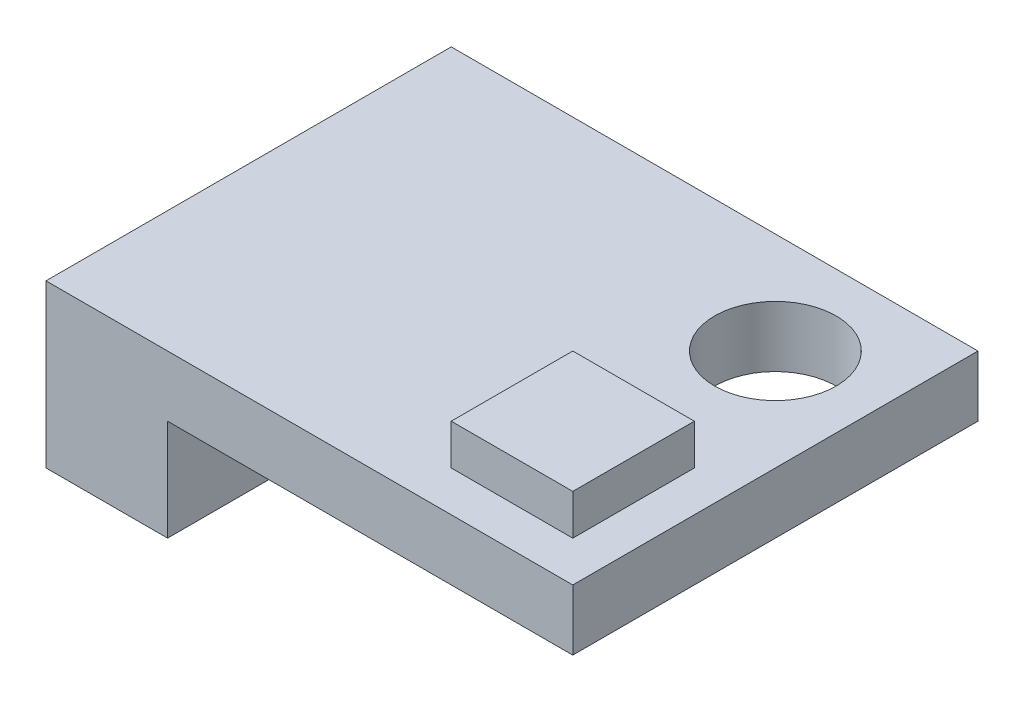
ISO-10303-21;
HEADER;
FILE_DESCRIPTION(('STEP AP214'),'2;1');
FILE_NAME('part.step','',(''),(''),'','','');
FILE_SCHEMA(('AUTOMOTIVE_DESIGN { 1 0 10303 214 1 1 1 1 }'));
ENDSEC;
DATA;
#1=APPLICATION_CONTEXT('core data for automotive mechanical design processes');
#2=APPLICATION_PROTOCOL_DEFINITION('international standard','automotive_design',2000,#1);
#3=PRODUCT_CONTEXT('',#1,'mechanical');
#4=PRODUCT('Part','Part','',(#3));
#5=PRODUCT_RELATED_PRODUCT_CATEGORY('part','',(#4));
#6=PRODUCT_DEFINITION_FORMATION('','',#4);
#7=PRODUCT_DEFINITION_CONTEXT('part definition',#1,'design');
#8=PRODUCT_DEFINITION('design','',#6,#7);
#9=PRODUCT_DEFINITION_SHAPE('','',#8);
#10=(LENGTH_UNIT() NAMED_UNIT(*) SI_UNIT(.MILLI.,.METRE.));
#11=(NAMED_UNIT(*) PLANE_ANGLE_UNIT() SI_UNIT($,.RADIAN.));
#12=(NAMED_UNIT(*) SI_UNIT($,.STERADIAN.) SOLID_ANGLE_UNIT());
#13=UNCERTAINTY_MEASURE_WITH_UNIT(LENGTH_MEASURE(1.E-05),#10,'distance_accuracy_value','');
#14=(GEOMETRIC_REPRESENTATION_CONTEXT(3) GLOBAL_UNCERTAINTY_ASSIGNED_CONTEXT((#13)) GLOBAL_UNIT_ASSIGNED_CONTEXT((#10,
#11,#12)) REPRESENTATION_CONTEXT('',''));
#15=CARTESIAN_POINT('',(0.,0.,0.));
#16=DIRECTION('',(0.,0.,1.));
#17=DIRECTION('',(1.,0.,0.));
#18=AXIS2_PLACEMENT_3D('',#15,#16,#17);
#19=CARTESIAN_POINT('',(0.,1.5,0.));
#20=DIRECTION('',(0.,1.,0.));
#21=DIRECTION('',(0.,0.,1.));
#22=AXIS2_PLACEMENT_3D('',#19,#20,#21);
#23=PLANE('',#22);
#24=DIRECTION('',(-1.,0.,0.));
#25=VECTOR('',#24,1.);
#26=CARTESIAN_POINT('',(0.,1.5,5.));
#27=LINE('',#26,#25);
#28=CARTESIAN_POINT('',(6.5,1.5,5.));
#29=VERTEX_POINT('',#28);
#30=CARTESIAN_POINT('',(-6.5,1.5,5.));
#31=VERTEX_POINT('',#30);
#32=EDGE_CURVE('E196',#29,#31,#27,.T.);
#33=ORIENTED_EDGE('',*,*,#32,.F.);
#34=DIRECTION('',(0.,0.,1.));
#35=VECTOR('',#34,1.);
#36=CARTESIAN_POINT('',(6.5,1.5,0.));
#37=LINE('',#36,#35);
#38=CARTESIAN_POINT('',(6.5,1.5,-5.));
#39=VERTEX_POINT('',#38);
#40=EDGE_CURVE('E200',#39,#29,#37,.T.);
#41=ORIENTED_EDGE('',*,*,#40,.F.);
#42=DIRECTION('',(-1.,0.,0.));
#43=VECTOR('',#42,1.);
#44=CARTESIAN_POINT('',(0.,1.5,-5.));
#45=LINE('',#44,#43);
#46=CARTESIAN_POINT('',(-6.5,1.5,-5.));
#47=VERTEX_POINT('',#46);
#48=EDGE_CURVE('E205',#39,#47,#45,.T.);
#49=ORIENTED_EDGE('',*,*,#48,.T.);
#50=DIRECTION('',(0.,0.,1.));
#51=VECTOR('',#50,1.);
#52=CARTESIAN_POINT('',(-6.5,1.5,0.));
#53=LINE('',#52,#51);
#54=EDGE_CURVE('E208',#47,#31,#53,.T.);
#55=ORIENTED_EDGE('',*,*,#54,.T.);
#56=EDGE_LOOP('',(#33,#41,#49,#55));
#57=FACE_BOUND('',#56,.T.);
#58=CARTESIAN_POINT('',(4.,1.5,-2.5));
#59=DIRECTION('',(0.,1.,0.));
#60=DIRECTION('',(0.,0.,1.));
#61=AXIS2_PLACEMENT_3D('',#58,#59,#60);
#62=CIRCLE('',#61,1.5);
#63=CARTESIAN_POINT('',(4.,1.5,-0.999999999999999));
#64=VERTEX_POINT('',#63);
#65=EDGE_CURVE('E211',#64,#64,#62,.T.);
#66=ORIENTED_EDGE('',*,*,#65,.F.);
#67=EDGE_LOOP('',(#66));
#68=FACE_BOUND('',#67,.T.);
#69=DIRECTION('',(1.,0.,0.));
#70=VECTOR('',#69,1.);
#71=CARTESIAN_POINT('',(0.,1.5,1.));
#72=LINE('',#71,#70);
#73=CARTESIAN_POINT('',(2.5,1.5,0.999999999999999));
#74=VERTEX_POINT('',#73);
#75=CARTESIAN_POINT('',(5.5,1.5,0.999999999999999));
#76=VERTEX_POINT('',#75);
#77=EDGE_CURVE('E155',#74,#76,#72,.T.);
#78=ORIENTED_EDGE('',*,*,#77,.T.);
#79=DIRECTION('',(0.,0.,-1.));
#80=VECTOR('',#79,1.);
#81=CARTESIAN_POINT('',(5.5,1.5,0.));
#82=LINE('',#81,#80);
#83=CARTESIAN_POINT('',(5.5,1.5,4.));
#84=VERTEX_POINT('',#83);
#85=EDGE_CURVE('E136',#84,#76,#82,.T.);
#86=ORIENTED_EDGE('',*,*,#85,.F.);
#87=DIRECTION('',(1.,0.,0.));
#88=VECTOR('',#87,1.);
#89=CARTESIAN_POINT('',(0.,1.5,4.));
#90=LINE('',#89,#88);
#91=CARTESIAN_POINT('',(2.5,1.5,4.));
#92=VERTEX_POINT('',#91);
#93=EDGE_CURVE('E130',#92,#84,#90,.T.);
#94=ORIENTED_EDGE('',*,*,#93,.F.);
#95=DIRECTION('',(0.,0.,-1.));
#96=VECTOR('',#95,1.);
#97=CARTESIAN_POINT('',(2.5,1.5,0.));
#98=LINE('',#97,#96);
#99=EDGE_CURVE('E55',#92,#74,#98,.T.);
#100=ORIENTED_EDGE('',*,*,#99,.T.);
#101=EDGE_LOOP('',(#78,#86,#94,#100));
#102=FACE_BOUND('',#101,.T.);
#103=ADVANCED_FACE('F39',(#57,#68,#102),#23,.T.);
#104=CARTESIAN_POINT('',(0.,0.,0.));
#105=DIRECTION('',(0.,1.,0.));
#106=DIRECTION('',(0.,0.,1.));
#107=AXIS2_PLACEMENT_3D('',#104,#105,#106);
#108=PLANE('',#107);
#109=CARTESIAN_POINT('',(4.,0.,-2.5));
#110=DIRECTION('',(0.,1.,0.));
#111=DIRECTION('',(0.,0.,1.));
#112=AXIS2_PLACEMENT_3D('',#109,#110,#111);
#113=CIRCLE('',#112,1.5);
#114=CARTESIAN_POINT('',(4.,0.,-0.999999999999999));
#115=VERTEX_POINT('',#114);
#116=EDGE_CURVE('E201',#115,#115,#113,.T.);
#117=ORIENTED_EDGE('',*,*,#116,.T.);
#118=EDGE_LOOP('',(#117));
#119=FACE_BOUND('',#118,.T.);
#120=DIRECTION('',(0.,0.,1.));
#121=VECTOR('',#120,1.);
#122=CARTESIAN_POINT('',(-3.5,0.,0.));
#123=LINE('',#122,#121);
#124=CARTESIAN_POINT('',(-3.5,0.,-5.));
#125=VERTEX_POINT('',#124);
#126=CARTESIAN_POINT('',(-3.5,0.,5.));
#127=VERTEX_POINT('',#126);
#128=EDGE_CURVE('E63',#125,#127,#123,.T.);
#129=ORIENTED_EDGE('',*,*,#128,.F.);
#130=DIRECTION('',(-1.,0.,0.));
#131=VECTOR('',#130,1.);
#132=CARTESIAN_POINT('',(0.,0.,-5.));
#133=LINE('',#132,#131);
#134=CARTESIAN_POINT('',(6.5,0.,-5.));
#135=VERTEX_POINT('',#134);
#136=EDGE_CURVE('E222',#135,#125,#133,.T.);
#137=ORIENTED_EDGE('',*,*,#136,.F.);
#138=DIRECTION('',(0.,0.,1.));
#139=VECTOR('',#138,1.);
#140=CARTESIAN_POINT('',(6.5,0.,0.));
#141=LINE('',#140,#139);
#142=CARTESIAN_POINT('',(6.5,0.,5.));
#143=VERTEX_POINT('',#142);
#144=EDGE_CURVE('E218',#135,#143,#141,.T.);
#145=ORIENTED_EDGE('',*,*,#144,.T.);
#146=DIRECTION('',(-1.,0.,0.));
#147=VECTOR('',#146,1.);
#148=CARTESIAN_POINT('',(0.,0.,5.));
#149=LINE('',#148,#147);
#150=EDGE_CURVE('E192',#143,#127,#149,.T.);
#151=ORIENTED_EDGE('',*,*,#150,.T.);
#152=EDGE_LOOP('',(#129,#137,#145,#151));
#153=FACE_BOUND('',#152,.T.);
#154=ADVANCED_FACE('F240',(#119,#153),#108,.F.);
#155=CARTESIAN_POINT('',(0.,1.5,5.));
#156=DIRECTION('',(0.,0.,1.));
#157=DIRECTION('',(1.,0.,0.));
#158=AXIS2_PLACEMENT_3D('',#155,#156,#157);
#159=PLANE('',#158);
#160=ORIENTED_EDGE('',*,*,#150,.F.);
#161=DIRECTION('',(0.,-1.,0.));
#162=VECTOR('',#161,1.);
#163=CARTESIAN_POINT('',(6.5,1.5,5.));
#164=LINE('',#163,#162);
#165=EDGE_CURVE('E11',#29,#143,#164,.T.);
#166=ORIENTED_EDGE('',*,*,#165,.F.);
#167=ORIENTED_EDGE('',*,*,#32,.T.);
#168=DIRECTION('',(0.,-1.,0.));
#169=VECTOR('',#168,1.);
#170=CARTESIAN_POINT('',(-6.5,1.5,5.));
#171=LINE('',#170,#169);
#172=CARTESIAN_POINT('',(-6.5,-2.5,5.));
#173=VERTEX_POINT('',#172);
#174=EDGE_CURVE('E215',#31,#173,#171,.T.);
#175=ORIENTED_EDGE('',*,*,#174,.T.);
#176=DIRECTION('',(-1.,0.,0.));
#177=VECTOR('',#176,1.);
#178=CARTESIAN_POINT('',(0.,-2.5,5.));
#179=LINE('',#178,#177);
#180=CARTESIAN_POINT('',(-3.5,-2.5,5.));
#181=VERTEX_POINT('',#180);
#182=EDGE_CURVE('E181',#181,#173,#179,.T.);
#183=ORIENTED_EDGE('',*,*,#182,.F.);
#184=DIRECTION('',(0.,1.,0.));
#185=VECTOR('',#184,1.);
#186=CARTESIAN_POINT('',(-3.5,-2.5,5.));
#187=LINE('',#186,#185);
#188=EDGE_CURVE('E188',#181,#127,#187,.T.);
#189=ORIENTED_EDGE('',*,*,#188,.T.);
#190=EDGE_LOOP('',(#160,#166,#167,#175,#183,#189));
#191=FACE_BOUND('',#190,.T.);
#192=ADVANCED_FACE('F41',(#191),#159,.T.);
#193=CARTESIAN_POINT('',(6.5,1.5,0.));
#194=DIRECTION('',(1.,0.,0.));
#195=DIRECTION('',(0.,0.,-1.));
#196=AXIS2_PLACEMENT_3D('',#193,#194,#195);
#197=PLANE('',#196);
#198=ORIENTED_EDGE('',*,*,#144,.F.);
#199=DIRECTION('',(0.,-1.,0.));
#200=VECTOR('',#199,1.);
#201=CARTESIAN_POINT('',(6.5,1.5,-5.));
#202=LINE('',#201,#200);
#203=EDGE_CURVE('E48',#39,#135,#202,.T.);
#204=ORIENTED_EDGE('',*,*,#203,.F.);
#205=ORIENTED_EDGE('',*,*,#40,.T.);
#206=ORIENTED_EDGE('',*,*,#165,.T.);
#207=EDGE_LOOP('',(#198,#204,#205,#206));
#208=FACE_BOUND('',#207,.T.);
#209=ADVANCED_FACE('F241',(#208),#197,.T.);
#210=CARTESIAN_POINT('',(0.,1.5,-5.));
#211=DIRECTION('',(0.,0.,1.));
#212=DIRECTION('',(1.,0.,0.));
#213=AXIS2_PLACEMENT_3D('',#210,#211,#212);
#214=PLANE('',#213);
#215=ORIENTED_EDGE('',*,*,#136,.T.);
#216=DIRECTION('',(0.,1.,0.));
#217=VECTOR('',#216,1.);
#218=CARTESIAN_POINT('',(-3.5,-2.5,-5.));
#219=LINE('',#218,#217);
#220=CARTESIAN_POINT('',(-3.5,-2.5,-5.));
#221=VERTEX_POINT('',#220);
#222=EDGE_CURVE('E185',#221,#125,#219,.T.);
#223=ORIENTED_EDGE('',*,*,#222,.F.);
#224=DIRECTION('',(-1.,0.,0.));
#225=VECTOR('',#224,1.);
#226=CARTESIAN_POINT('',(0.,-2.5,-5.));
#227=LINE('',#226,#225);
#228=CARTESIAN_POINT('',(-6.5,-2.5,-5.));
#229=VERTEX_POINT('',#228);
#230=EDGE_CURVE('E173',#221,#229,#227,.T.);
#231=ORIENTED_EDGE('',*,*,#230,.T.);
#232=DIRECTION('',(0.,-1.,0.));
#233=VECTOR('',#232,1.);
#234=CARTESIAN_POINT('',(-6.5,1.5,-5.));
#235=LINE('',#234,#233);
#236=EDGE_CURVE('E230',#47,#229,#235,.T.);
#237=ORIENTED_EDGE('',*,*,#236,.F.);
#238=ORIENTED_EDGE('',*,*,#48,.F.);
#239=ORIENTED_EDGE('',*,*,#203,.T.);
#240=EDGE_LOOP('',(#215,#223,#231,#237,#238,#239));
#241=FACE_BOUND('',#240,.T.);
#242=ADVANCED_FACE('F235',(#241),#214,.F.);
#243=CARTESIAN_POINT('',(-6.5,1.5,0.));
#244=DIRECTION('',(1.,0.,0.));
#245=DIRECTION('',(0.,0.,-1.));
#246=AXIS2_PLACEMENT_3D('',#243,#244,#245);
#247=PLANE('',#246);
#248=ORIENTED_EDGE('',*,*,#236,.T.);
#249=DIRECTION('',(0.,0.,1.));
#250=VECTOR('',#249,1.);
#251=CARTESIAN_POINT('',(-6.5,-2.5,0.));
#252=LINE('',#251,#250);
#253=EDGE_CURVE('E177',#229,#173,#252,.T.);
#254=ORIENTED_EDGE('',*,*,#253,.T.);
#255=ORIENTED_EDGE('',*,*,#174,.F.);
#256=ORIENTED_EDGE('',*,*,#54,.F.);
#257=EDGE_LOOP('',(#248,#254,#255,#256));
#258=FACE_BOUND('',#257,.T.);
#259=ADVANCED_FACE('F256',(#258),#247,.F.);
#260=CARTESIAN_POINT('',(4.,1.5,-2.5));
#261=DIRECTION('',(0.,-1.,0.));
#262=DIRECTION('',(0.,0.,-1.));
#263=AXIS2_PLACEMENT_3D('',#260,#261,#262);
#264=CYLINDRICAL_SURFACE('',#263,1.5);
#265=ORIENTED_EDGE('',*,*,#65,.T.);
#266=EDGE_LOOP('',(#265));
#267=FACE_BOUND('',#266,.T.);
#268=ORIENTED_EDGE('',*,*,#116,.F.);
#269=EDGE_LOOP('',(#268));
#270=FACE_BOUND('',#269,.T.);
#271=ADVANCED_FACE('F282',(#267,#270),#264,.F.);
#272=CARTESIAN_POINT('',(-3.5,-2.5,0.));
#273=DIRECTION('',(-1.,0.,0.));
#274=DIRECTION('',(0.,0.,1.));
#275=AXIS2_PLACEMENT_3D('',#272,#273,#274);
#276=PLANE('',#275);
#277=ORIENTED_EDGE('',*,*,#128,.T.);
#278=ORIENTED_EDGE('',*,*,#188,.F.);
#279=DIRECTION('',(0.,0.,1.));
#280=VECTOR('',#279,1.);
#281=CARTESIAN_POINT('',(-3.5,-2.5,0.));
#282=LINE('',#281,#280);
#283=EDGE_CURVE('E169',#221,#181,#282,.T.);
#284=ORIENTED_EDGE('',*,*,#283,.F.);
#285=ORIENTED_EDGE('',*,*,#222,.T.);
#286=EDGE_LOOP('',(#277,#278,#284,#285));
#287=FACE_BOUND('',#286,.T.);
#288=ADVANCED_FACE('F248',(#287),#276,.F.);
#289=CARTESIAN_POINT('',(0.,-2.5,0.));
#290=DIRECTION('',(0.,1.,0.));
#291=DIRECTION('',(0.,0.,1.));
#292=AXIS2_PLACEMENT_3D('',#289,#290,#291);
#293=PLANE('',#292);
#294=ORIENTED_EDGE('',*,*,#283,.T.);
#295=ORIENTED_EDGE('',*,*,#182,.T.);
#296=ORIENTED_EDGE('',*,*,#253,.F.);
#297=ORIENTED_EDGE('',*,*,#230,.F.);
#298=EDGE_LOOP('',(#294,#295,#296,#297));
#299=FACE_BOUND('',#298,.T.);
#300=ADVANCED_FACE('F253',(#299),#293,.F.);
#301=CARTESIAN_POINT('',(5.5,2.5,0.));
#302=DIRECTION('',(-1.,0.,0.));
#303=DIRECTION('',(0.,0.,1.));
#304=AXIS2_PLACEMENT_3D('',#301,#302,#303);
#305=PLANE('',#304);
#306=ORIENTED_EDGE('',*,*,#85,.T.);
#307=DIRECTION('',(0.,-1.,0.));
#308=VECTOR('',#307,1.);
#309=CARTESIAN_POINT('',(5.5,2.5,0.999999999999999));
#310=LINE('',#309,#308);
#311=CARTESIAN_POINT('',(5.5,2.5,0.999999999999999));
#312=VERTEX_POINT('',#311);
#313=EDGE_CURVE('E133',#312,#76,#310,.T.);
#314=ORIENTED_EDGE('',*,*,#313,.F.);
#315=DIRECTION('',(0.,0.,-1.));
#316=VECTOR('',#315,1.);
#317=CARTESIAN_POINT('',(5.5,2.5,0.));
#318=LINE('',#317,#316);
#319=CARTESIAN_POINT('',(5.5,2.5,4.));
#320=VERTEX_POINT('',#319);
#321=EDGE_CURVE('E117',#320,#312,#318,.T.);
#322=ORIENTED_EDGE('',*,*,#321,.F.);
#323=DIRECTION('',(0.,-1.,0.));
#324=VECTOR('',#323,1.);
#325=CARTESIAN_POINT('',(5.5,2.5,4.));
#326=LINE('',#325,#324);
#327=EDGE_CURVE('E152',#320,#84,#326,.T.);
#328=ORIENTED_EDGE('',*,*,#327,.T.);
#329=EDGE_LOOP('',(#306,#314,#322,#328));
#330=FACE_BOUND('',#329,.T.);
#331=ADVANCED_FACE('F134',(#330),#305,.F.);
#332=CARTESIAN_POINT('',(0.,2.5,1.));
#333=DIRECTION('',(0.,0.,-1.));
#334=DIRECTION('',(-1.,0.,0.));
#335=AXIS2_PLACEMENT_3D('',#332,#333,#334);
#336=PLANE('',#335);
#337=ORIENTED_EDGE('',*,*,#77,.F.);
#338=DIRECTION('',(0.,-1.,0.));
#339=VECTOR('',#338,1.);
#340=CARTESIAN_POINT('',(2.5,2.5,0.999999999999999));
#341=LINE('',#340,#339);
#342=CARTESIAN_POINT('',(2.5,2.5,0.999999999999999));
#343=VERTEX_POINT('',#342);
#344=EDGE_CURVE('E141',#343,#74,#341,.T.);
#345=ORIENTED_EDGE('',*,*,#344,.F.);
#346=DIRECTION('',(1.,0.,0.));
#347=VECTOR('',#346,1.);
#348=CARTESIAN_POINT('',(0.,2.5,1.));
#349=LINE('',#348,#347);
#350=EDGE_CURVE('E122',#343,#312,#349,.T.);
#351=ORIENTED_EDGE('',*,*,#350,.T.);
#352=ORIENTED_EDGE('',*,*,#313,.T.);
#353=EDGE_LOOP('',(#337,#345,#351,#352));
#354=FACE_BOUND('',#353,.T.);
#355=ADVANCED_FACE('F143',(#354),#336,.T.);
#356=CARTESIAN_POINT('',(2.5,2.5,0.));
#357=DIRECTION('',(-1.,0.,0.));
#358=DIRECTION('',(0.,0.,1.));
#359=AXIS2_PLACEMENT_3D('',#356,#357,#358);
#360=PLANE('',#359);
#361=ORIENTED_EDGE('',*,*,#99,.F.);
#362=DIRECTION('',(0.,-1.,0.));
#363=VECTOR('',#362,1.);
#364=CARTESIAN_POINT('',(2.5,2.5,4.));
#365=LINE('',#364,#363);
#366=CARTESIAN_POINT('',(2.5,2.5,4.));
#367=VERTEX_POINT('',#366);
#368=EDGE_CURVE('E164',#367,#92,#365,.T.);
#369=ORIENTED_EDGE('',*,*,#368,.F.);
#370=DIRECTION('',(0.,0.,-1.));
#371=VECTOR('',#370,1.);
#372=CARTESIAN_POINT('',(2.5,2.5,0.));
#373=LINE('',#372,#371);
#374=EDGE_CURVE('E145',#367,#343,#373,.T.);
#375=ORIENTED_EDGE('',*,*,#374,.T.);
#376=ORIENTED_EDGE('',*,*,#344,.T.);
#377=EDGE_LOOP('',(#361,#369,#375,#376));
#378=FACE_BOUND('',#377,.T.);
#379=ADVANCED_FACE('F266',(#378),#360,.T.);
#380=CARTESIAN_POINT('',(0.,2.5,4.));
#381=DIRECTION('',(0.,0.,-1.));
#382=DIRECTION('',(-1.,0.,0.));
#383=AXIS2_PLACEMENT_3D('',#380,#381,#382);
#384=PLANE('',#383);
#385=ORIENTED_EDGE('',*,*,#93,.T.);
#386=ORIENTED_EDGE('',*,*,#327,.F.);
#387=DIRECTION('',(1.,0.,0.));
#388=VECTOR('',#387,1.);
#389=CARTESIAN_POINT('',(0.,2.5,4.));
#390=LINE('',#389,#388);
#391=EDGE_CURVE('E125',#367,#320,#390,.T.);
#392=ORIENTED_EDGE('',*,*,#391,.F.);
#393=ORIENTED_EDGE('',*,*,#368,.T.);
#394=EDGE_LOOP('',(#385,#386,#392,#393));
#395=FACE_BOUND('',#394,.T.);
#396=ADVANCED_FACE('F265',(#395),#384,.F.);
#397=CARTESIAN_POINT('',(0.,2.5,0.));
#398=DIRECTION('',(0.,-1.,0.));
#399=DIRECTION('',(0.,0.,-1.));
#400=AXIS2_PLACEMENT_3D('',#397,#398,#399);
#401=PLANE('',#400);
#402=ORIENTED_EDGE('',*,*,#321,.T.);
#403=ORIENTED_EDGE('',*,*,#350,.F.);
#404=ORIENTED_EDGE('',*,*,#374,.F.);
#405=ORIENTED_EDGE('',*,*,#391,.T.);
#406=EDGE_LOOP('',(#402,#403,#404,#405));
#407=FACE_BOUND('',#406,.T.);
#408=ADVANCED_FACE('F119',(#407),#401,.F.);
#409=CLOSED_SHELL('',(#103,#154,#192,#209,#242,#259,#271,#288,#300,#331,#355,#379,#396,#408));
#410=MANIFOLD_SOLID_BREP('B2',#409);
#411=ADVANCED_BREP_SHAPE_REPRESENTATION('',(#18,#410),#14);
#412=SHAPE_DEFINITION_REPRESENTATION(#9,#411);
ENDSEC;
END-ISO-10303-21;
